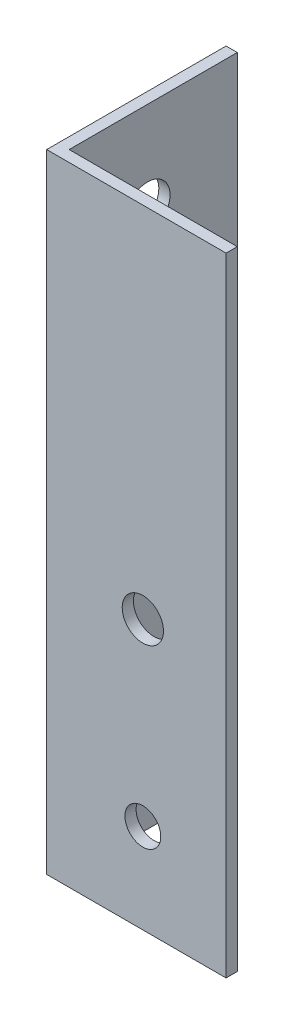
ISO-10303-21;
HEADER;
FILE_DESCRIPTION(('STEP AP214'),'2;1');
FILE_NAME('part.step','',(''),(''),'','','');
FILE_SCHEMA(('AUTOMOTIVE_DESIGN { 1 0 10303 214 1 1 1 1 }'));
ENDSEC;
DATA;
#1=APPLICATION_CONTEXT('core data for automotive mechanical design processes');
#2=APPLICATION_PROTOCOL_DEFINITION('international standard','automotive_design',2000,#1);
#3=PRODUCT_CONTEXT('',#1,'mechanical');
#4=PRODUCT('Part','Part','',(#3));
#5=PRODUCT_RELATED_PRODUCT_CATEGORY('part','',(#4));
#6=PRODUCT_DEFINITION_FORMATION('','',#4);
#7=PRODUCT_DEFINITION_CONTEXT('part definition',#1,'design');
#8=PRODUCT_DEFINITION('design','',#6,#7);
#9=PRODUCT_DEFINITION_SHAPE('','',#8);
#10=(LENGTH_UNIT() NAMED_UNIT(*) SI_UNIT(.MILLI.,.METRE.));
#11=(NAMED_UNIT(*) PLANE_ANGLE_UNIT() SI_UNIT($,.RADIAN.));
#12=(NAMED_UNIT(*) SI_UNIT($,.STERADIAN.) SOLID_ANGLE_UNIT());
#13=UNCERTAINTY_MEASURE_WITH_UNIT(LENGTH_MEASURE(1.E-05),#10,'distance_accuracy_value','');
#14=(GEOMETRIC_REPRESENTATION_CONTEXT(3) GLOBAL_UNCERTAINTY_ASSIGNED_CONTEXT((#13)) GLOBAL_UNIT_ASSIGNED_CONTEXT((#10,
#11,#12)) REPRESENTATION_CONTEXT('',''));
#15=CARTESIAN_POINT('',(0.,0.,0.));
#16=DIRECTION('',(0.,0.,1.));
#17=DIRECTION('',(1.,0.,0.));
#18=AXIS2_PLACEMENT_3D('',#15,#16,#17);
#19=CARTESIAN_POINT('',(1.5875,88.9,-25.4));
#20=DIRECTION('',(0.,0.,1.));
#21=DIRECTION('',(1.,0.,0.));
#22=AXIS2_PLACEMENT_3D('',#19,#20,#21);
#23=PLANE('',#22);
#24=DIRECTION('',(-1.,0.,0.));
#25=VECTOR('',#24,1.);
#26=CARTESIAN_POINT('',(1.5875,0.,-25.4));
#27=LINE('',#26,#25);
#28=CARTESIAN_POINT('',(1.5875,0.,-25.4));
#29=VERTEX_POINT('',#28);
#30=CARTESIAN_POINT('',(0.,0.,-25.4));
#31=VERTEX_POINT('',#30);
#32=EDGE_CURVE('E116',#29,#31,#27,.T.);
#33=ORIENTED_EDGE('',*,*,#32,.T.);
#34=DIRECTION('',(0.,-1.,0.));
#35=VECTOR('',#34,1.);
#36=CARTESIAN_POINT('',(0.,88.9,-25.4));
#37=LINE('',#36,#35);
#38=CARTESIAN_POINT('',(0.,88.9,-25.4));
#39=VERTEX_POINT('',#38);
#40=EDGE_CURVE('E11',#39,#31,#37,.T.);
#41=ORIENTED_EDGE('',*,*,#40,.F.);
#42=DIRECTION('',(-1.,0.,0.));
#43=VECTOR('',#42,1.);
#44=CARTESIAN_POINT('',(1.5875,88.9,-25.4));
#45=LINE('',#44,#43);
#46=CARTESIAN_POINT('',(1.5875,88.9,-25.4));
#47=VERTEX_POINT('',#46);
#48=EDGE_CURVE('E127',#47,#39,#45,.T.);
#49=ORIENTED_EDGE('',*,*,#48,.F.);
#50=DIRECTION('',(0.,-1.,0.));
#51=VECTOR('',#50,1.);
#52=CARTESIAN_POINT('',(1.5875,88.9,-25.4));
#53=LINE('',#52,#51);
#54=EDGE_CURVE('E112',#47,#29,#53,.T.);
#55=ORIENTED_EDGE('',*,*,#54,.T.);
#56=EDGE_LOOP('',(#33,#41,#49,#55));
#57=FACE_BOUND('',#56,.T.);
#58=ADVANCED_FACE('F32',(#57),#23,.F.);
#59=CARTESIAN_POINT('',(0.,88.9,-25.4));
#60=DIRECTION('',(1.,0.,0.));
#61=DIRECTION('',(0.,0.,-1.));
#62=AXIS2_PLACEMENT_3D('',#59,#60,#61);
#63=PLANE('',#62);
#64=CARTESIAN_POINT('',(0.,76.2,-12.7));
#65=DIRECTION('',(1.,0.,0.));
#66=DIRECTION('',(0.,0.,-1.));
#67=AXIS2_PLACEMENT_3D('',#64,#65,#66);
#68=CIRCLE('',#67,3.175);
#69=CARTESIAN_POINT('',(0.,76.2,-15.875));
#70=VERTEX_POINT('',#69);
#71=EDGE_CURVE('E237',#70,#70,#68,.T.);
#72=ORIENTED_EDGE('',*,*,#71,.T.);
#73=EDGE_LOOP('',(#72));
#74=FACE_BOUND('',#73,.T.);
#75=DIRECTION('',(0.,0.,1.));
#76=VECTOR('',#75,1.);
#77=CARTESIAN_POINT('',(0.,0.,-25.4));
#78=LINE('',#77,#76);
#79=CARTESIAN_POINT('',(0.,0.,0.));
#80=VERTEX_POINT('',#79);
#81=EDGE_CURVE('E119',#31,#80,#78,.T.);
#82=ORIENTED_EDGE('',*,*,#81,.T.);
#83=DIRECTION('',(0.,-1.,0.));
#84=VECTOR('',#83,1.);
#85=CARTESIAN_POINT('',(0.,88.9,0.));
#86=LINE('',#85,#84);
#87=CARTESIAN_POINT('',(0.,88.9,0.));
#88=VERTEX_POINT('',#87);
#89=EDGE_CURVE('E40',#88,#80,#86,.T.);
#90=ORIENTED_EDGE('',*,*,#89,.F.);
#91=DIRECTION('',(0.,0.,1.));
#92=VECTOR('',#91,1.);
#93=CARTESIAN_POINT('',(0.,88.9,-25.4));
#94=LINE('',#93,#92);
#95=EDGE_CURVE('E85',#39,#88,#94,.T.);
#96=ORIENTED_EDGE('',*,*,#95,.F.);
#97=ORIENTED_EDGE('',*,*,#40,.T.);
#98=EDGE_LOOP('',(#82,#90,#96,#97));
#99=FACE_BOUND('',#98,.T.);
#100=ADVANCED_FACE('F154',(#74,#99),#63,.F.);
#101=CARTESIAN_POINT('',(0.,88.9,0.));
#102=DIRECTION('',(0.,0.,-1.));
#103=DIRECTION('',(-1.,0.,0.));
#104=AXIS2_PLACEMENT_3D('',#101,#102,#103);
#105=PLANE('',#104);
#106=CARTESIAN_POINT('',(13.6129474478447,38.1,0.));
#107=DIRECTION('',(0.,0.,-1.));
#108=DIRECTION('',(-1.,0.,0.));
#109=AXIS2_PLACEMENT_3D('',#106,#107,#108);
#110=CIRCLE('',#109,2.92285796539846);
#111=CARTESIAN_POINT('',(10.6900894824463,38.1,0.));
#112=VERTEX_POINT('',#111);
#113=EDGE_CURVE('E241',#112,#112,#110,.T.);
#114=ORIENTED_EDGE('',*,*,#113,.T.);
#115=EDGE_LOOP('',(#114));
#116=FACE_BOUND('',#115,.T.);
#117=CARTESIAN_POINT('',(13.6129474478447,12.7,0.));
#118=DIRECTION('',(0.,0.,-1.));
#119=DIRECTION('',(-1.,0.,0.));
#120=AXIS2_PLACEMENT_3D('',#117,#118,#119);
#121=CIRCLE('',#120,2.54);
#122=CARTESIAN_POINT('',(11.0729474478447,12.7,0.));
#123=VERTEX_POINT('',#122);
#124=EDGE_CURVE('E120',#123,#123,#121,.T.);
#125=ORIENTED_EDGE('',*,*,#124,.T.);
#126=EDGE_LOOP('',(#125));
#127=FACE_BOUND('',#126,.T.);
#128=DIRECTION('',(1.,0.,0.));
#129=VECTOR('',#128,1.);
#130=CARTESIAN_POINT('',(0.,0.,0.));
#131=LINE('',#130,#129);
#132=CARTESIAN_POINT('',(25.4,0.,0.));
#133=VERTEX_POINT('',#132);
#134=EDGE_CURVE('E122',#80,#133,#131,.T.);
#135=ORIENTED_EDGE('',*,*,#134,.T.);
#136=DIRECTION('',(0.,-1.,0.));
#137=VECTOR('',#136,1.);
#138=CARTESIAN_POINT('',(25.4,88.9,0.));
#139=LINE('',#138,#137);
#140=CARTESIAN_POINT('',(25.4,88.9,0.));
#141=VERTEX_POINT('',#140);
#142=EDGE_CURVE('E107',#141,#133,#139,.T.);
#143=ORIENTED_EDGE('',*,*,#142,.F.);
#144=DIRECTION('',(1.,0.,0.));
#145=VECTOR('',#144,1.);
#146=CARTESIAN_POINT('',(0.,88.9,0.));
#147=LINE('',#146,#145);
#148=EDGE_CURVE('E98',#88,#141,#147,.T.);
#149=ORIENTED_EDGE('',*,*,#148,.F.);
#150=ORIENTED_EDGE('',*,*,#89,.T.);
#151=EDGE_LOOP('',(#135,#143,#149,#150));
#152=FACE_BOUND('',#151,.T.);
#153=ADVANCED_FACE('F133',(#116,#127,#152),#105,.F.);
#154=CARTESIAN_POINT('',(25.4,88.9,0.));
#155=DIRECTION('',(-1.,0.,0.));
#156=DIRECTION('',(0.,0.,1.));
#157=AXIS2_PLACEMENT_3D('',#154,#155,#156);
#158=PLANE('',#157);
#159=DIRECTION('',(0.,0.,-1.));
#160=VECTOR('',#159,1.);
#161=CARTESIAN_POINT('',(25.4,0.,0.));
#162=LINE('',#161,#160);
#163=CARTESIAN_POINT('',(25.4,0.,-1.5875));
#164=VERTEX_POINT('',#163);
#165=EDGE_CURVE('E106',#133,#164,#162,.T.);
#166=ORIENTED_EDGE('',*,*,#165,.T.);
#167=DIRECTION('',(0.,-1.,0.));
#168=VECTOR('',#167,1.);
#169=CARTESIAN_POINT('',(25.4,88.9,-1.5875));
#170=LINE('',#169,#168);
#171=CARTESIAN_POINT('',(25.4,88.9,-1.5875));
#172=VERTEX_POINT('',#171);
#173=EDGE_CURVE('E103',#172,#164,#170,.T.);
#174=ORIENTED_EDGE('',*,*,#173,.F.);
#175=DIRECTION('',(0.,0.,-1.));
#176=VECTOR('',#175,1.);
#177=CARTESIAN_POINT('',(25.4,88.9,0.));
#178=LINE('',#177,#176);
#179=EDGE_CURVE('E92',#141,#172,#178,.T.);
#180=ORIENTED_EDGE('',*,*,#179,.F.);
#181=ORIENTED_EDGE('',*,*,#142,.T.);
#182=EDGE_LOOP('',(#166,#174,#180,#181));
#183=FACE_BOUND('',#182,.T.);
#184=ADVANCED_FACE('F104',(#183),#158,.F.);
#185=CARTESIAN_POINT('',(25.4,88.9,-1.5875));
#186=DIRECTION('',(0.,0.,1.));
#187=DIRECTION('',(1.,0.,0.));
#188=AXIS2_PLACEMENT_3D('',#185,#186,#187);
#189=PLANE('',#188);
#190=CARTESIAN_POINT('',(13.6129474478447,38.1,-1.5875));
#191=DIRECTION('',(0.,0.,-1.));
#192=DIRECTION('',(-1.,0.,0.));
#193=AXIS2_PLACEMENT_3D('',#190,#191,#192);
#194=CIRCLE('',#193,2.92285796539846);
#195=CARTESIAN_POINT('',(10.6900894824463,38.1,-1.5875));
#196=VERTEX_POINT('',#195);
#197=EDGE_CURVE('E238',#196,#196,#194,.T.);
#198=ORIENTED_EDGE('',*,*,#197,.F.);
#199=EDGE_LOOP('',(#198));
#200=FACE_BOUND('',#199,.T.);
#201=CARTESIAN_POINT('',(13.6129474478447,12.7,-1.5875));
#202=DIRECTION('',(0.,0.,-1.));
#203=DIRECTION('',(-1.,0.,0.));
#204=AXIS2_PLACEMENT_3D('',#201,#202,#203);
#205=CIRCLE('',#204,2.54);
#206=CARTESIAN_POINT('',(11.0729474478447,12.7,-1.5875));
#207=VERTEX_POINT('',#206);
#208=EDGE_CURVE('E247',#207,#207,#205,.T.);
#209=ORIENTED_EDGE('',*,*,#208,.F.);
#210=EDGE_LOOP('',(#209));
#211=FACE_BOUND('',#210,.T.);
#212=DIRECTION('',(-1.,0.,0.));
#213=VECTOR('',#212,1.);
#214=CARTESIAN_POINT('',(25.4,0.,-1.5875));
#215=LINE('',#214,#213);
#216=CARTESIAN_POINT('',(1.5875,0.,-1.5875));
#217=VERTEX_POINT('',#216);
#218=EDGE_CURVE('E71',#164,#217,#215,.T.);
#219=ORIENTED_EDGE('',*,*,#218,.T.);
#220=DIRECTION('',(0.,-1.,0.));
#221=VECTOR('',#220,1.);
#222=CARTESIAN_POINT('',(1.5875,88.9,-1.5875));
#223=LINE('',#222,#221);
#224=CARTESIAN_POINT('',(1.5875,88.9,-1.5875));
#225=VERTEX_POINT('',#224);
#226=EDGE_CURVE('E108',#225,#217,#223,.T.);
#227=ORIENTED_EDGE('',*,*,#226,.F.);
#228=DIRECTION('',(-1.,0.,0.));
#229=VECTOR('',#228,1.);
#230=CARTESIAN_POINT('',(25.4,88.9,-1.5875));
#231=LINE('',#230,#229);
#232=EDGE_CURVE('E96',#172,#225,#231,.T.);
#233=ORIENTED_EDGE('',*,*,#232,.F.);
#234=ORIENTED_EDGE('',*,*,#173,.T.);
#235=EDGE_LOOP('',(#219,#227,#233,#234));
#236=FACE_BOUND('',#235,.T.);
#237=ADVANCED_FACE('F110',(#200,#211,#236),#189,.F.);
#238=CARTESIAN_POINT('',(1.5875,88.9,-1.5875));
#239=DIRECTION('',(-1.,0.,0.));
#240=DIRECTION('',(0.,0.,1.));
#241=AXIS2_PLACEMENT_3D('',#238,#239,#240);
#242=PLANE('',#241);
#243=CARTESIAN_POINT('',(1.5875,76.2,-12.7));
#244=DIRECTION('',(1.,0.,0.));
#245=DIRECTION('',(0.,0.,-1.));
#246=AXIS2_PLACEMENT_3D('',#243,#244,#245);
#247=CIRCLE('',#246,3.175);
#248=CARTESIAN_POINT('',(1.5875,76.2,-15.875));
#249=VERTEX_POINT('',#248);
#250=EDGE_CURVE('E235',#249,#249,#247,.T.);
#251=ORIENTED_EDGE('',*,*,#250,.F.);
#252=EDGE_LOOP('',(#251));
#253=FACE_BOUND('',#252,.T.);
#254=DIRECTION('',(0.,0.,-1.));
#255=VECTOR('',#254,1.);
#256=CARTESIAN_POINT('',(1.5875,0.,-1.5875));
#257=LINE('',#256,#255);
#258=EDGE_CURVE('E77',#217,#29,#257,.T.);
#259=ORIENTED_EDGE('',*,*,#258,.T.);
#260=ORIENTED_EDGE('',*,*,#54,.F.);
#261=DIRECTION('',(0.,0.,-1.));
#262=VECTOR('',#261,1.);
#263=CARTESIAN_POINT('',(1.5875,88.9,-1.5875));
#264=LINE('',#263,#262);
#265=EDGE_CURVE('E48',#225,#47,#264,.T.);
#266=ORIENTED_EDGE('',*,*,#265,.F.);
#267=ORIENTED_EDGE('',*,*,#226,.T.);
#268=EDGE_LOOP('',(#259,#260,#266,#267));
#269=FACE_BOUND('',#268,.T.);
#270=ADVANCED_FACE('F140',(#253,#269),#242,.F.);
#271=CARTESIAN_POINT('',(0.,88.9,0.));
#272=DIRECTION('',(0.,1.,0.));
#273=DIRECTION('',(0.,0.,1.));
#274=AXIS2_PLACEMENT_3D('',#271,#272,#273);
#275=PLANE('',#274);
#276=ORIENTED_EDGE('',*,*,#48,.T.);
#277=ORIENTED_EDGE('',*,*,#95,.T.);
#278=ORIENTED_EDGE('',*,*,#148,.T.);
#279=ORIENTED_EDGE('',*,*,#179,.T.);
#280=ORIENTED_EDGE('',*,*,#232,.T.);
#281=ORIENTED_EDGE('',*,*,#265,.T.);
#282=EDGE_LOOP('',(#276,#277,#278,#279,#280,#281));
#283=FACE_BOUND('',#282,.T.);
#284=ADVANCED_FACE('F94',(#283),#275,.T.);
#285=CARTESIAN_POINT('',(0.,0.,0.));
#286=DIRECTION('',(0.,1.,0.));
#287=DIRECTION('',(0.,0.,1.));
#288=AXIS2_PLACEMENT_3D('',#285,#286,#287);
#289=PLANE('',#288);
#290=ORIENTED_EDGE('',*,*,#32,.F.);
#291=ORIENTED_EDGE('',*,*,#258,.F.);
#292=ORIENTED_EDGE('',*,*,#218,.F.);
#293=ORIENTED_EDGE('',*,*,#165,.F.);
#294=ORIENTED_EDGE('',*,*,#134,.F.);
#295=ORIENTED_EDGE('',*,*,#81,.F.);
#296=EDGE_LOOP('',(#290,#291,#292,#293,#294,#295));
#297=FACE_BOUND('',#296,.T.);
#298=ADVANCED_FACE('F136',(#297),#289,.F.);
#299=CARTESIAN_POINT('',(13.6129474478447,12.7,87.3125));
#300=DIRECTION('',(0.,0.,-1.));
#301=DIRECTION('',(-1.,0.,0.));
#302=AXIS2_PLACEMENT_3D('',#299,#300,#301);
#303=CYLINDRICAL_SURFACE('',#302,2.54);
#304=ORIENTED_EDGE('',*,*,#208,.T.);
#305=EDGE_LOOP('',(#304));
#306=FACE_BOUND('',#305,.T.);
#307=ORIENTED_EDGE('',*,*,#124,.F.);
#308=EDGE_LOOP('',(#307));
#309=FACE_BOUND('',#308,.T.);
#310=ADVANCED_FACE('F185',(#306,#309),#303,.F.);
#311=CARTESIAN_POINT('',(13.6129474478447,38.1,87.3125));
#312=DIRECTION('',(0.,0.,-1.));
#313=DIRECTION('',(-1.,0.,0.));
#314=AXIS2_PLACEMENT_3D('',#311,#312,#313);
#315=CYLINDRICAL_SURFACE('',#314,2.92285796539846);
#316=ORIENTED_EDGE('',*,*,#197,.T.);
#317=EDGE_LOOP('',(#316));
#318=FACE_BOUND('',#317,.T.);
#319=ORIENTED_EDGE('',*,*,#113,.F.);
#320=EDGE_LOOP('',(#319));
#321=FACE_BOUND('',#320,.T.);
#322=ADVANCED_FACE('F190',(#318,#321),#315,.F.);
#323=CARTESIAN_POINT('',(-87.3125,76.2,-12.7));
#324=DIRECTION('',(1.,0.,0.));
#325=DIRECTION('',(0.,0.,-1.));
#326=AXIS2_PLACEMENT_3D('',#323,#324,#325);
#327=CYLINDRICAL_SURFACE('',#326,3.175);
#328=ORIENTED_EDGE('',*,*,#250,.T.);
#329=EDGE_LOOP('',(#328));
#330=FACE_BOUND('',#329,.T.);
#331=ORIENTED_EDGE('',*,*,#71,.F.);
#332=EDGE_LOOP('',(#331));
#333=FACE_BOUND('',#332,.T.);
#334=ADVANCED_FACE('F201',(#330,#333),#327,.F.);
#335=CLOSED_SHELL('',(#58,#100,#153,#184,#237,#270,#284,#298,#310,#322,#334));
#336=MANIFOLD_SOLID_BREP('B2',#335);
#337=ADVANCED_BREP_SHAPE_REPRESENTATION('',(#18,#336),#14);
#338=SHAPE_DEFINITION_REPRESENTATION(#9,#337);
ENDSEC;
END-ISO-10303-21;
